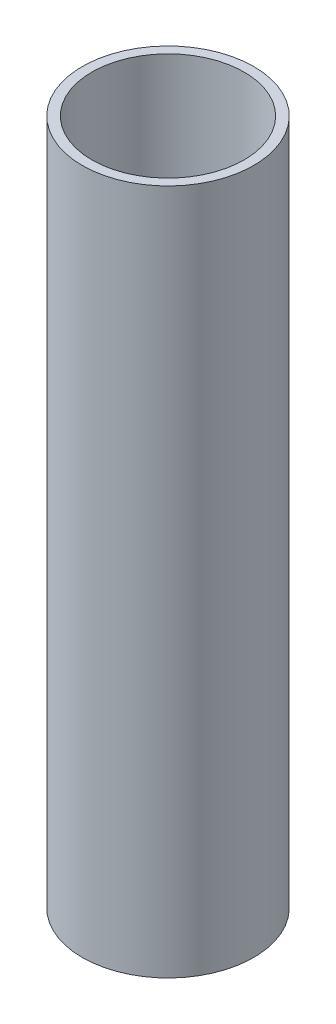
ISO-10303-21;
HEADER;
FILE_DESCRIPTION(('STEP AP214'),'2;1');
FILE_NAME('part.step','',(''),(''),'','','');
FILE_SCHEMA(('AUTOMOTIVE_DESIGN { 1 0 10303 214 1 1 1 1 }'));
ENDSEC;
DATA;
#1=APPLICATION_CONTEXT('core data for automotive mechanical design processes');
#2=APPLICATION_PROTOCOL_DEFINITION('international standard','automotive_design',2000,#1);
#3=PRODUCT_CONTEXT('',#1,'mechanical');
#4=PRODUCT('Part','Part','',(#3));
#5=PRODUCT_RELATED_PRODUCT_CATEGORY('part','',(#4));
#6=PRODUCT_DEFINITION_FORMATION('','',#4);
#7=PRODUCT_DEFINITION_CONTEXT('part definition',#1,'design');
#8=PRODUCT_DEFINITION('design','',#6,#7);
#9=PRODUCT_DEFINITION_SHAPE('','',#8);
#10=(LENGTH_UNIT() NAMED_UNIT(*) SI_UNIT(.MILLI.,.METRE.));
#11=(NAMED_UNIT(*) PLANE_ANGLE_UNIT() SI_UNIT($,.RADIAN.));
#12=(NAMED_UNIT(*) SI_UNIT($,.STERADIAN.) SOLID_ANGLE_UNIT());
#13=UNCERTAINTY_MEASURE_WITH_UNIT(LENGTH_MEASURE(1.E-05),#10,'distance_accuracy_value','');
#14=(GEOMETRIC_REPRESENTATION_CONTEXT(3) GLOBAL_UNCERTAINTY_ASSIGNED_CONTEXT((#13)) GLOBAL_UNIT_ASSIGNED_CONTEXT((#10,
#11,#12)) REPRESENTATION_CONTEXT('',''));
#15=CARTESIAN_POINT('',(0.,0.,0.));
#16=DIRECTION('',(0.,0.,1.));
#17=DIRECTION('',(1.,0.,0.));
#18=AXIS2_PLACEMENT_3D('',#15,#16,#17);
#19=CARTESIAN_POINT('',(0.,50.8,0.));
#20=DIRECTION('',(0.,1.,0.));
#21=DIRECTION('',(0.,0.,1.));
#22=AXIS2_PLACEMENT_3D('',#19,#20,#21);
#23=PLANE('',#22);
#24=CARTESIAN_POINT('',(0.,50.8,0.));
#25=DIRECTION('',(0.,1.,0.));
#26=DIRECTION('',(0.,0.,1.));
#27=AXIS2_PLACEMENT_3D('',#24,#25,#26);
#28=CIRCLE('',#27,6.35);
#29=CARTESIAN_POINT('',(0.,50.8,6.35));
#30=VERTEX_POINT('',#29);
#31=EDGE_CURVE('E10',#30,#30,#28,.T.);
#32=ORIENTED_EDGE('',*,*,#31,.T.);
#33=EDGE_LOOP('',(#32));
#34=FACE_BOUND('',#33,.T.);
#35=CARTESIAN_POINT('',(0.,50.8,0.));
#36=DIRECTION('',(0.,1.,0.));
#37=DIRECTION('',(0.,0.,1.));
#38=AXIS2_PLACEMENT_3D('',#35,#36,#37);
#39=CIRCLE('',#38,5.6388);
#40=CARTESIAN_POINT('',(0.,50.8,5.6388));
#41=VERTEX_POINT('',#40);
#42=EDGE_CURVE('E42',#41,#41,#39,.T.);
#43=ORIENTED_EDGE('',*,*,#42,.F.);
#44=EDGE_LOOP('',(#43));
#45=FACE_BOUND('',#44,.T.);
#46=ADVANCED_FACE('F31',(#34,#45),#23,.T.);
#47=CARTESIAN_POINT('',(0.,0.,0.));
#48=DIRECTION('',(0.,1.,0.));
#49=DIRECTION('',(0.,0.,1.));
#50=AXIS2_PLACEMENT_3D('',#47,#48,#49);
#51=PLANE('',#50);
#52=CARTESIAN_POINT('',(0.,0.,0.));
#53=DIRECTION('',(0.,1.,0.));
#54=DIRECTION('',(0.,0.,1.));
#55=AXIS2_PLACEMENT_3D('',#52,#53,#54);
#56=CIRCLE('',#55,6.35);
#57=CARTESIAN_POINT('',(0.,0.,6.35));
#58=VERTEX_POINT('',#57);
#59=EDGE_CURVE('E35',#58,#58,#56,.T.);
#60=ORIENTED_EDGE('',*,*,#59,.F.);
#61=EDGE_LOOP('',(#60));
#62=FACE_BOUND('',#61,.T.);
#63=CARTESIAN_POINT('',(0.,0.,0.));
#64=DIRECTION('',(0.,1.,0.));
#65=DIRECTION('',(0.,0.,1.));
#66=AXIS2_PLACEMENT_3D('',#63,#64,#65);
#67=CIRCLE('',#66,5.6388);
#68=CARTESIAN_POINT('',(0.,0.,5.6388));
#69=VERTEX_POINT('',#68);
#70=EDGE_CURVE('E44',#69,#69,#67,.T.);
#71=ORIENTED_EDGE('',*,*,#70,.T.);
#72=EDGE_LOOP('',(#71));
#73=FACE_BOUND('',#72,.T.);
#74=ADVANCED_FACE('F54',(#62,#73),#51,.F.);
#75=CARTESIAN_POINT('',(0.,50.8,0.));
#76=DIRECTION('',(0.,-1.,0.));
#77=DIRECTION('',(0.,0.,-1.));
#78=AXIS2_PLACEMENT_3D('',#75,#76,#77);
#79=CYLINDRICAL_SURFACE('',#78,6.35);
#80=ORIENTED_EDGE('',*,*,#31,.F.);
#81=EDGE_LOOP('',(#80));
#82=FACE_BOUND('',#81,.T.);
#83=ORIENTED_EDGE('',*,*,#59,.T.);
#84=EDGE_LOOP('',(#83));
#85=FACE_BOUND('',#84,.T.);
#86=ADVANCED_FACE('F33',(#82,#85),#79,.T.);
#87=CARTESIAN_POINT('',(0.,50.8,0.));
#88=DIRECTION('',(0.,-1.,0.));
#89=DIRECTION('',(0.,0.,-1.));
#90=AXIS2_PLACEMENT_3D('',#87,#88,#89);
#91=CYLINDRICAL_SURFACE('',#90,5.6388);
#92=ORIENTED_EDGE('',*,*,#42,.T.);
#93=EDGE_LOOP('',(#92));
#94=FACE_BOUND('',#93,.T.);
#95=ORIENTED_EDGE('',*,*,#70,.F.);
#96=EDGE_LOOP('',(#95));
#97=FACE_BOUND('',#96,.T.);
#98=ADVANCED_FACE('F50',(#94,#97),#91,.F.);
#99=CLOSED_SHELL('',(#46,#74,#86,#98));
#100=MANIFOLD_SOLID_BREP('B2',#99);
#101=ADVANCED_BREP_SHAPE_REPRESENTATION('',(#18,#100),#14);
#102=SHAPE_DEFINITION_REPRESENTATION(#9,#101);
ENDSEC;
END-ISO-10303-21;
